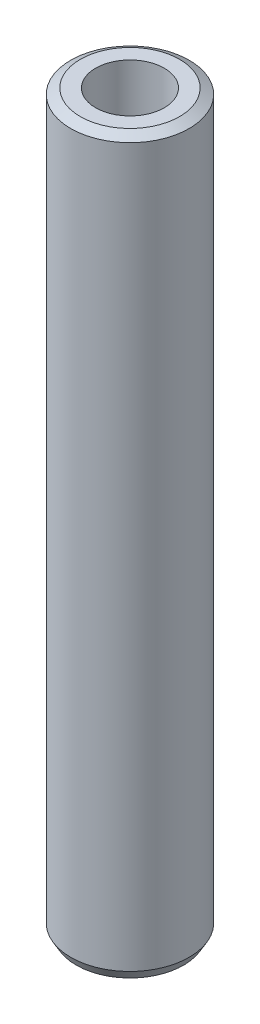
ISO-10303-21;
HEADER;
FILE_DESCRIPTION(('STEP AP214'),'2;1');
FILE_NAME('part.step','',(''),(''),'','','');
FILE_SCHEMA(('AUTOMOTIVE_DESIGN { 1 0 10303 214 1 1 1 1 }'));
ENDSEC;
DATA;
#1=APPLICATION_CONTEXT('core data for automotive mechanical design processes');
#2=APPLICATION_PROTOCOL_DEFINITION('international standard','automotive_design',2000,#1);
#3=PRODUCT_CONTEXT('',#1,'mechanical');
#4=PRODUCT('Part','Part','',(#3));
#5=PRODUCT_RELATED_PRODUCT_CATEGORY('part','',(#4));
#6=PRODUCT_DEFINITION_FORMATION('','',#4);
#7=PRODUCT_DEFINITION_CONTEXT('part definition',#1,'design');
#8=PRODUCT_DEFINITION('design','',#6,#7);
#9=PRODUCT_DEFINITION_SHAPE('','',#8);
#10=(LENGTH_UNIT() NAMED_UNIT(*) SI_UNIT(.MILLI.,.METRE.));
#11=(NAMED_UNIT(*) PLANE_ANGLE_UNIT() SI_UNIT($,.RADIAN.));
#12=(NAMED_UNIT(*) SI_UNIT($,.STERADIAN.) SOLID_ANGLE_UNIT());
#13=UNCERTAINTY_MEASURE_WITH_UNIT(LENGTH_MEASURE(1.E-05),#10,'distance_accuracy_value','');
#14=(GEOMETRIC_REPRESENTATION_CONTEXT(3) GLOBAL_UNCERTAINTY_ASSIGNED_CONTEXT((#13)) GLOBAL_UNIT_ASSIGNED_CONTEXT((#10,
#11,#12)) REPRESENTATION_CONTEXT('',''));
#15=CARTESIAN_POINT('',(0.,0.,0.));
#16=DIRECTION('',(0.,0.,1.));
#17=DIRECTION('',(1.,0.,0.));
#18=AXIS2_PLACEMENT_3D('',#15,#16,#17);
#19=CARTESIAN_POINT('',(0.,494.948348474099,0.));
#20=DIRECTION('',(0.,-1.,0.));
#21=DIRECTION('',(0.,0.,-1.));
#22=AXIS2_PLACEMENT_3D('',#19,#20,#21);
#23=CYLINDRICAL_SURFACE('',#22,40.);
#24=CARTESIAN_POINT('',(0.,491.209938940651,0.));
#25=DIRECTION('',(0.,1.,0.));
#26=DIRECTION('',(0.,0.,1.));
#27=AXIS2_PLACEMENT_3D('',#24,#25,#26);
#28=CIRCLE('',#27,40.);
#29=CARTESIAN_POINT('',(0.,491.209938940651,40.));
#30=VERTEX_POINT('',#29);
#31=EDGE_CURVE('E50',#30,#30,#28,.F.);
#32=ORIENTED_EDGE('',*,*,#31,.T.);
#33=EDGE_LOOP('',(#32));
#34=FACE_BOUND('',#33,.T.);
#35=CARTESIAN_POINT('',(0.,6.47511525143257,0.));
#36=DIRECTION('',(0.,1.,0.));
#37=DIRECTION('',(0.,0.,1.));
#38=AXIS2_PLACEMENT_3D('',#35,#36,#37);
#39=CIRCLE('',#38,40.);
#40=CARTESIAN_POINT('',(0.,6.47511525143257,40.));
#41=VERTEX_POINT('',#40);
#42=EDGE_CURVE('E51',#41,#41,#39,.T.);
#43=ORIENTED_EDGE('',*,*,#42,.T.);
#44=EDGE_LOOP('',(#43));
#45=FACE_BOUND('',#44,.T.);
#46=ADVANCED_FACE('F39',(#34,#45),#23,.T.);
#47=CARTESIAN_POINT('',(0.,494.948348474099,0.));
#48=DIRECTION('',(0.,1.,0.));
#49=DIRECTION('',(0.,0.,1.));
#50=AXIS2_PLACEMENT_3D('',#47,#48,#49);
#51=PLANE('',#50);
#52=CARTESIAN_POINT('',(0.,494.948348474099,0.));
#53=DIRECTION('',(0.,1.,0.));
#54=DIRECTION('',(0.,0.,1.));
#55=AXIS2_PLACEMENT_3D('',#52,#53,#54);
#56=CIRCLE('',#55,33.5248847485674);
#57=CARTESIAN_POINT('',(0.,494.948348474099,33.5248847485674));
#58=VERTEX_POINT('',#57);
#59=EDGE_CURVE('E54',#58,#58,#56,.T.);
#60=ORIENTED_EDGE('',*,*,#59,.T.);
#61=EDGE_LOOP('',(#60));
#62=FACE_BOUND('',#61,.T.);
#63=CARTESIAN_POINT('',(0.,494.948348474099,0.));
#64=DIRECTION('',(0.,1.,0.));
#65=DIRECTION('',(0.,0.,1.));
#66=AXIS2_PLACEMENT_3D('',#63,#64,#65);
#67=CIRCLE('',#66,23.1864497377258);
#68=CARTESIAN_POINT('',(0.,494.948348474099,23.1864497377258));
#69=VERTEX_POINT('',#68);
#70=EDGE_CURVE('E58',#69,#69,#67,.T.);
#71=ORIENTED_EDGE('',*,*,#70,.F.);
#72=EDGE_LOOP('',(#71));
#73=FACE_BOUND('',#72,.T.);
#74=ADVANCED_FACE('F69',(#62,#73),#51,.T.);
#75=CARTESIAN_POINT('',(0.,0.,0.));
#76=DIRECTION('',(0.,1.,0.));
#77=DIRECTION('',(0.,0.,1.));
#78=AXIS2_PLACEMENT_3D('',#75,#76,#77);
#79=PLANE('',#78);
#80=CARTESIAN_POINT('',(0.,0.,0.));
#81=DIRECTION('',(0.,1.,0.));
#82=DIRECTION('',(0.,0.,1.));
#83=AXIS2_PLACEMENT_3D('',#80,#81,#82);
#84=CIRCLE('',#83,36.2615904665515);
#85=CARTESIAN_POINT('',(0.,0.,36.2615904665515));
#86=VERTEX_POINT('',#85);
#87=EDGE_CURVE('E10',#86,#86,#84,.F.);
#88=ORIENTED_EDGE('',*,*,#87,.T.);
#89=EDGE_LOOP('',(#88));
#90=FACE_BOUND('',#89,.T.);
#91=CARTESIAN_POINT('',(0.,0.,0.));
#92=DIRECTION('',(0.,1.,0.));
#93=DIRECTION('',(0.,0.,1.));
#94=AXIS2_PLACEMENT_3D('',#91,#92,#93);
#95=CIRCLE('',#94,23.1864497377258);
#96=CARTESIAN_POINT('',(0.,0.,23.1864497377258));
#97=VERTEX_POINT('',#96);
#98=EDGE_CURVE('E63',#97,#97,#95,.T.);
#99=ORIENTED_EDGE('',*,*,#98,.T.);
#100=EDGE_LOOP('',(#99));
#101=FACE_BOUND('',#100,.T.);
#102=ADVANCED_FACE('F75',(#90,#101),#79,.F.);
#103=CARTESIAN_POINT('',(0.,494.948348474099,0.));
#104=DIRECTION('',(0.,-1.,0.));
#105=DIRECTION('',(0.,0.,-1.));
#106=AXIS2_PLACEMENT_3D('',#103,#104,#105);
#107=CYLINDRICAL_SURFACE('',#106,23.1864497377258);
#108=ORIENTED_EDGE('',*,*,#70,.T.);
#109=EDGE_LOOP('',(#108));
#110=FACE_BOUND('',#109,.T.);
#111=ORIENTED_EDGE('',*,*,#98,.F.);
#112=EDGE_LOOP('',(#111));
#113=FACE_BOUND('',#112,.T.);
#114=ADVANCED_FACE('F70',(#110,#113),#107,.F.);
#115=CARTESIAN_POINT('',(0.,494.948348474099,0.));
#116=DIRECTION('',(0.,-1.,0.));
#117=DIRECTION('',(0.,0.,-1.));
#118=AXIS2_PLACEMENT_3D('',#115,#116,#117);
#119=CONICAL_SURFACE('',#118,33.5248847485674,1.0471975511966);
#120=ORIENTED_EDGE('',*,*,#31,.F.);
#121=EDGE_LOOP('',(#120));
#122=FACE_BOUND('',#121,.T.);
#123=ORIENTED_EDGE('',*,*,#59,.F.);
#124=EDGE_LOOP('',(#123));
#125=FACE_BOUND('',#124,.T.);
#126=ADVANCED_FACE('F81',(#122,#125),#119,.T.);
#127=CARTESIAN_POINT('',(0.,6.47511525143257,0.));
#128=DIRECTION('',(0.,1.,0.));
#129=DIRECTION('',(0.,0.,1.));
#130=AXIS2_PLACEMENT_3D('',#127,#128,#129);
#131=CONICAL_SURFACE('',#130,40.,0.523598775598308);
#132=CARTESIAN_POINT('',(0.,0.,36.2615904665515));
#133=CARTESIAN_POINT('',(0.,0.0674491172024218,36.3005322325249));
#134=CARTESIAN_POINT('',(0.,0.134898234404844,36.3394739984983));
#135=CARTESIAN_POINT('',(0.,0.26979646880969,36.4173575304452));
#136=CARTESIAN_POINT('',(0.,0.337245586012112,36.4562992964186));
#137=CARTESIAN_POINT('',(0.,0.472143820416958,36.5341828283654));
#138=CARTESIAN_POINT('',(0.,0.53959293761938,36.5731245943389));
#139=CARTESIAN_POINT('',(0.,0.674491172024225,36.6510081262857));
#140=CARTESIAN_POINT('',(0.,0.741940289226648,36.6899498922591));
#141=CARTESIAN_POINT('',(0.,0.876838523631493,36.767833424206));
#142=CARTESIAN_POINT('',(0.,0.944287640833916,36.8067751901794));
#143=CARTESIAN_POINT('',(0.,1.07918587523876,36.8846587221262));
#144=CARTESIAN_POINT('',(0.,1.14663499244118,36.9236004880996));
#145=CARTESIAN_POINT('',(0.,1.28153322684603,37.0014840200465));
#146=CARTESIAN_POINT('',(0.,1.34898234404845,37.0404257860199));
#147=CARTESIAN_POINT('',(0.,1.4838805784533,37.1183093179668));
#148=CARTESIAN_POINT('',(0.,1.55132969565572,37.1572510839402));
#149=CARTESIAN_POINT('',(0.,1.68622793006056,37.235134615887));
#150=CARTESIAN_POINT('',(0.,1.75367704726299,37.2740763818604));
#151=CARTESIAN_POINT('',(0.,1.88857528166783,37.3519599138073));
#152=CARTESIAN_POINT('',(0.,1.95602439887026,37.3909016797807));
#153=CARTESIAN_POINT('',(0.,2.0909226332751,37.4687852117276));
#154=CARTESIAN_POINT('',(0.,2.15837175047752,37.507726977701));
#155=CARTESIAN_POINT('',(0.,2.29326998488237,37.5856105096478));
#156=CARTESIAN_POINT('',(0.,2.36071910208479,37.6245522756212));
#157=CARTESIAN_POINT('',(0.,2.49561733648964,37.7024358075681));
#158=CARTESIAN_POINT('',(0.,2.56306645369206,37.7413775735415));
#159=CARTESIAN_POINT('',(0.,2.6979646880969,37.8192611054884));
#160=CARTESIAN_POINT('',(0.,2.76541380529933,37.8582028714618));
#161=CARTESIAN_POINT('',(0.,2.90031203970417,37.9360864034086));
#162=CARTESIAN_POINT('',(0.,2.9677611569066,37.975028169382));
#163=CARTESIAN_POINT('',(0.,3.10265939131144,38.0529117013289));
#164=CARTESIAN_POINT('',(0.,3.17010850851386,38.0918534673023));
#165=CARTESIAN_POINT('',(0.,3.30500674291871,38.1697369992492));
#166=CARTESIAN_POINT('',(0.,3.37245586012113,38.2086787652226));
#167=CARTESIAN_POINT('',(0.,3.50735409452598,38.2865622971694));
#168=CARTESIAN_POINT('',(0.,3.5748032117284,38.3255040631429));
#169=CARTESIAN_POINT('',(0.,3.70970144613324,38.4033875950897));
#170=CARTESIAN_POINT('',(0.,3.77715056333567,38.4423293610631));
#171=CARTESIAN_POINT('',(0.,3.91204879774051,38.52021289301));
#172=CARTESIAN_POINT('',(0.,3.97949791494294,38.5591546589834));
#173=CARTESIAN_POINT('',(0.,4.11439614934778,38.6370381909302));
#174=CARTESIAN_POINT('',(0.,4.1818452665502,38.6759799569036));
#175=CARTESIAN_POINT('',(0.,4.31674350095505,38.7538634888505));
#176=CARTESIAN_POINT('',(0.,4.38419261815747,38.7928052548239));
#177=CARTESIAN_POINT('',(0.,4.51909085256232,38.8706887867708));
#178=CARTESIAN_POINT('',(0.,4.58653996976474,38.9096305527442));
#179=CARTESIAN_POINT('',(0.,4.72143820416958,38.987514084691));
#180=CARTESIAN_POINT('',(0.,4.78888732137201,39.0264558506644));
#181=CARTESIAN_POINT('',(0.,4.92378555577685,39.1043393826113));
#182=CARTESIAN_POINT('',(0.,4.99123467297927,39.1432811485847));
#183=CARTESIAN_POINT('',(0.,5.12613290738412,39.2211646805316));
#184=CARTESIAN_POINT('',(0.,5.19358202458654,39.260106446505));
#185=CARTESIAN_POINT('',(0.,5.32848025899139,39.3379899784518));
#186=CARTESIAN_POINT('',(0.,5.39592937619381,39.3769317444252));
#187=CARTESIAN_POINT('',(0.,5.53082761059866,39.4548152763721));
#188=CARTESIAN_POINT('',(0.,5.59827672780108,39.4937570423455));
#189=CARTESIAN_POINT('',(0.,5.73317496220592,39.5716405742924));
#190=CARTESIAN_POINT('',(0.,5.80062407940835,39.6105823402658));
#191=CARTESIAN_POINT('',(0.,5.93552231381319,39.6884658722126));
#192=CARTESIAN_POINT('',(0.,6.00297143101561,39.727407638186));
#193=CARTESIAN_POINT('',(0.,6.13786966542046,39.8052911701329));
#194=CARTESIAN_POINT('',(0.,6.20531878262288,39.8442329361063));
#195=CARTESIAN_POINT('',(0.,6.34021701702773,39.9221164680532));
#196=CARTESIAN_POINT('',(0.,6.40766613423015,39.9610582340266));
#197=CARTESIAN_POINT('',(0.,6.47511525143257,40.));
#198=B_SPLINE_CURVE_WITH_KNOTS('',3,(#132,#133,#134,#135,#136,#137,#138,#139,#140,#141,#142,
#143,#144,#145,#146,#147,#148,#149,#150,#151,#152,#153,#154,#155,#156,#157,#158,#159,#160,#161,
#162,#163,#164,#165,#166,#167,#168,#169,#170,#171,#172,#173,#174,#175,#176,#177,#178,#179,#180,
#181,#182,#183,#184,#185,#186,#187,#188,#189,#190,#191,#192,#193,#194,#195,#196,#197),
.UNSPECIFIED.,.F.,.F.,(4,2,2,2,2,2,2,2,2,2,2,2,2,2,2,2,2,2,2,2,2,2,2,2,2,2,2,2,2,2,2,2,4),(0.,
0.233650595840529,0.467301191681058,0.700951787521587,0.934602383362115,1.16825297920264,
1.40190357504317,1.63555417088371,1.86920476672423,2.10285536256476,2.33650595840529,
2.57015655424582,2.80380715008635,3.03745774592688,3.27110834176741,3.50475893760794,
3.73840953344847,3.97206012928899,4.20571072512953,4.43936132097006,4.67301191681059,
4.90666251265111,5.14031310849164,5.37396370433217,5.6076143001727,5.84126489601323,
6.07491549185376,6.30856608769429,6.54221668353482,6.77586727937535,7.00951787521588,
7.24316847105641,7.47681906689694),.UNSPECIFIED.);
#199=EDGE_CURVE('BSEAM45',#86,#41,#198,.T.);
#200=ORIENTED_EDGE('',*,*,#87,.F.);
#201=ORIENTED_EDGE('',*,*,#42,.F.);
#202=ORIENTED_EDGE('',*,*,#199,.T.);
#203=ORIENTED_EDGE('',*,*,#199,.F.);
#204=EDGE_LOOP('',(#200,#202,#201,#203));
#205=FACE_BOUND('',#204,.T.);
#206=ADVANCED_FACE('F45',(#205),#131,.T.);
#207=CLOSED_SHELL('',(#46,#74,#102,#114,#126,#206));
#208=MANIFOLD_SOLID_BREP('B2',#207);
#209=ADVANCED_BREP_SHAPE_REPRESENTATION('',(#18,#208),#14);
#210=SHAPE_DEFINITION_REPRESENTATION(#9,#209);
ENDSEC;
END-ISO-10303-21;
